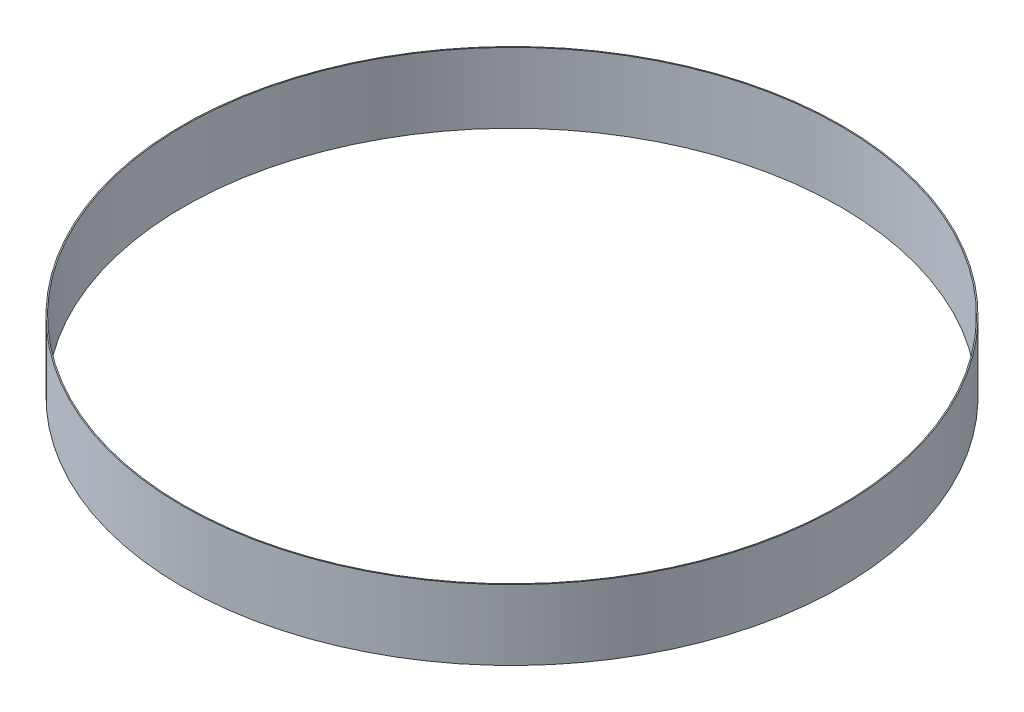
ISO-10303-21;
HEADER;
FILE_DESCRIPTION(('STEP AP214'),'2;1');
FILE_NAME('part.step','',(''),(''),'','','');
FILE_SCHEMA(('AUTOMOTIVE_DESIGN { 1 0 10303 214 1 1 1 1 }'));
ENDSEC;
DATA;
#1=APPLICATION_CONTEXT('core data for automotive mechanical design processes');
#2=APPLICATION_PROTOCOL_DEFINITION('international standard','automotive_design',2000,#1);
#3=PRODUCT_CONTEXT('',#1,'mechanical');
#4=PRODUCT('Part','Part','',(#3));
#5=PRODUCT_RELATED_PRODUCT_CATEGORY('part','',(#4));
#6=PRODUCT_DEFINITION_FORMATION('','',#4);
#7=PRODUCT_DEFINITION_CONTEXT('part definition',#1,'design');
#8=PRODUCT_DEFINITION('design','',#6,#7);
#9=PRODUCT_DEFINITION_SHAPE('','',#8);
#10=(LENGTH_UNIT() NAMED_UNIT(*) SI_UNIT(.MILLI.,.METRE.));
#11=(NAMED_UNIT(*) PLANE_ANGLE_UNIT() SI_UNIT($,.RADIAN.));
#12=(NAMED_UNIT(*) SI_UNIT($,.STERADIAN.) SOLID_ANGLE_UNIT());
#13=UNCERTAINTY_MEASURE_WITH_UNIT(LENGTH_MEASURE(1.E-05),#10,'distance_accuracy_value','');
#14=(GEOMETRIC_REPRESENTATION_CONTEXT(3) GLOBAL_UNCERTAINTY_ASSIGNED_CONTEXT((#13)) GLOBAL_UNIT_ASSIGNED_CONTEXT((#10,
#11,#12)) REPRESENTATION_CONTEXT('',''));
#15=CARTESIAN_POINT('',(0.,0.,0.));
#16=DIRECTION('',(0.,0.,1.));
#17=DIRECTION('',(1.,0.,0.));
#18=AXIS2_PLACEMENT_3D('',#15,#16,#17);
#19=CARTESIAN_POINT('',(0.,32.,0.));
#20=DIRECTION('',(0.,-1.,0.));
#21=DIRECTION('',(0.,0.,-1.));
#22=AXIS2_PLACEMENT_3D('',#19,#20,#21);
#23=CYLINDRICAL_SURFACE('',#22,150.5);
#24=CARTESIAN_POINT('',(0.,32.,0.));
#25=DIRECTION('',(0.,1.,0.));
#26=DIRECTION('',(0.,0.,1.));
#27=AXIS2_PLACEMENT_3D('',#24,#25,#26);
#28=CIRCLE('',#27,150.5);
#29=CARTESIAN_POINT('',(0.,32.,150.5));
#30=VERTEX_POINT('',#29);
#31=EDGE_CURVE('E10',#30,#30,#28,.T.);
#32=ORIENTED_EDGE('',*,*,#31,.F.);
#33=EDGE_LOOP('',(#32));
#34=FACE_BOUND('',#33,.T.);
#35=CARTESIAN_POINT('',(0.,0.,0.));
#36=DIRECTION('',(0.,1.,0.));
#37=DIRECTION('',(0.,0.,1.));
#38=AXIS2_PLACEMENT_3D('',#35,#36,#37);
#39=CIRCLE('',#38,150.5);
#40=CARTESIAN_POINT('',(0.,0.,150.5));
#41=VERTEX_POINT('',#40);
#42=EDGE_CURVE('E46',#41,#41,#39,.T.);
#43=ORIENTED_EDGE('',*,*,#42,.T.);
#44=EDGE_LOOP('',(#43));
#45=FACE_BOUND('',#44,.T.);
#46=ADVANCED_FACE('F43',(#34,#45),#23,.T.);
#47=CARTESIAN_POINT('',(0.,32.,0.));
#48=DIRECTION('',(0.,1.,0.));
#49=DIRECTION('',(0.,0.,1.));
#50=AXIS2_PLACEMENT_3D('',#47,#48,#49);
#51=PLANE('',#50);
#52=CARTESIAN_POINT('',(0.,32.,0.));
#53=DIRECTION('',(0.,1.,0.));
#54=DIRECTION('',(0.,0.,1.));
#55=AXIS2_PLACEMENT_3D('',#52,#53,#54);
#56=CIRCLE('',#55,150.);
#57=CARTESIAN_POINT('',(0.,32.,150.));
#58=VERTEX_POINT('',#57);
#59=EDGE_CURVE('E57',#58,#58,#56,.T.);
#60=ORIENTED_EDGE('',*,*,#59,.F.);
#61=EDGE_LOOP('',(#60));
#62=FACE_BOUND('',#61,.T.);
#63=ORIENTED_EDGE('',*,*,#31,.T.);
#64=EDGE_LOOP('',(#63));
#65=FACE_BOUND('',#64,.T.);
#66=ADVANCED_FACE('F74',(#62,#65),#51,.T.);
#67=CARTESIAN_POINT('',(0.,0.,0.));
#68=DIRECTION('',(0.,1.,0.));
#69=DIRECTION('',(0.,0.,1.));
#70=AXIS2_PLACEMENT_3D('',#67,#68,#69);
#71=PLANE('',#70);
#72=CARTESIAN_POINT('',(0.,0.,0.));
#73=DIRECTION('',(0.,1.,0.));
#74=DIRECTION('',(0.,0.,1.));
#75=AXIS2_PLACEMENT_3D('',#72,#73,#74);
#76=CIRCLE('',#75,150.);
#77=CARTESIAN_POINT('',(0.,0.,150.));
#78=VERTEX_POINT('',#77);
#79=EDGE_CURVE('E55',#78,#78,#76,.T.);
#80=ORIENTED_EDGE('',*,*,#79,.T.);
#81=EDGE_LOOP('',(#80));
#82=FACE_BOUND('',#81,.T.);
#83=ORIENTED_EDGE('',*,*,#42,.F.);
#84=EDGE_LOOP('',(#83));
#85=FACE_BOUND('',#84,.T.);
#86=ADVANCED_FACE('F65',(#82,#85),#71,.F.);
#87=CARTESIAN_POINT('',(0.,0.,0.));
#88=DIRECTION('',(0.,1.,0.));
#89=DIRECTION('',(0.,0.,1.));
#90=AXIS2_PLACEMENT_3D('',#87,#88,#89);
#91=CYLINDRICAL_SURFACE('',#90,150.);
#92=ORIENTED_EDGE('',*,*,#79,.F.);
#93=EDGE_LOOP('',(#92));
#94=FACE_BOUND('',#93,.T.);
#95=ORIENTED_EDGE('',*,*,#59,.T.);
#96=EDGE_LOOP('',(#95));
#97=FACE_BOUND('',#96,.T.);
#98=ADVANCED_FACE('F68',(#94,#97),#91,.F.);
#99=CLOSED_SHELL('',(#46,#66,#86,#98));
#100=MANIFOLD_SOLID_BREP('B2',#99);
#101=ADVANCED_BREP_SHAPE_REPRESENTATION('',(#18,#100),#14);
#102=SHAPE_DEFINITION_REPRESENTATION(#9,#101);
ENDSEC;
END-ISO-10303-21;
